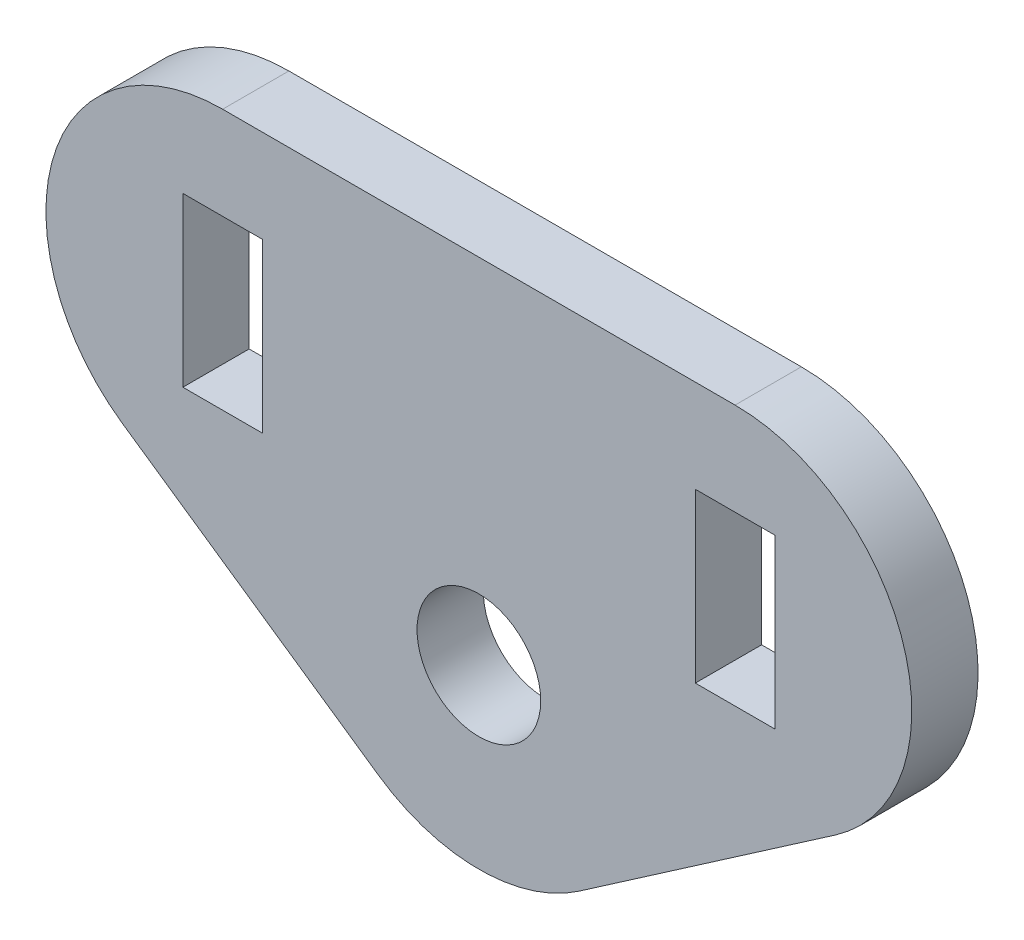
ISO-10303-21;
HEADER;
FILE_DESCRIPTION(('STEP AP214'),'2;1');
FILE_NAME('part.step','',(''),(''),'','','');
FILE_SCHEMA(('AUTOMOTIVE_DESIGN { 1 0 10303 214 1 1 1 1 }'));
ENDSEC;
DATA;
#1=APPLICATION_CONTEXT('core data for automotive mechanical design processes');
#2=APPLICATION_PROTOCOL_DEFINITION('international standard','automotive_design',2000,#1);
#3=PRODUCT_CONTEXT('',#1,'mechanical');
#4=PRODUCT('Part','Part','',(#3));
#5=PRODUCT_RELATED_PRODUCT_CATEGORY('part','',(#4));
#6=PRODUCT_DEFINITION_FORMATION('','',#4);
#7=PRODUCT_DEFINITION_CONTEXT('part definition',#1,'design');
#8=PRODUCT_DEFINITION('design','',#6,#7);
#9=PRODUCT_DEFINITION_SHAPE('','',#8);
#10=(LENGTH_UNIT() NAMED_UNIT(*) SI_UNIT(.MILLI.,.METRE.));
#11=(NAMED_UNIT(*) PLANE_ANGLE_UNIT() SI_UNIT($,.RADIAN.));
#12=(NAMED_UNIT(*) SI_UNIT($,.STERADIAN.) SOLID_ANGLE_UNIT());
#13=UNCERTAINTY_MEASURE_WITH_UNIT(LENGTH_MEASURE(1.E-05),#10,'distance_accuracy_value','');
#14=(GEOMETRIC_REPRESENTATION_CONTEXT(3) GLOBAL_UNCERTAINTY_ASSIGNED_CONTEXT((#13)) GLOBAL_UNIT_ASSIGNED_CONTEXT((#10,
#11,#12)) REPRESENTATION_CONTEXT('',''));
#15=CARTESIAN_POINT('',(0.,0.,0.));
#16=DIRECTION('',(0.,0.,1.));
#17=DIRECTION('',(1.,0.,0.));
#18=AXIS2_PLACEMENT_3D('',#15,#16,#17);
#19=CARTESIAN_POINT('',(0.,0.,15.));
#20=DIRECTION('',(0.,0.,-1.));
#21=DIRECTION('',(-1.,0.,0.));
#22=AXIS2_PLACEMENT_3D('',#19,#20,#21);
#23=PLANE('',#22);
#24=DIRECTION('',(0.,1.,0.));
#25=VECTOR('',#24,1.);
#26=CARTESIAN_POINT('',(-49.,21.,15.));
#27=LINE('',#26,#25);
#28=CARTESIAN_POINT('',(-49.,21.,15.));
#29=VERTEX_POINT('',#28);
#30=CARTESIAN_POINT('',(-49.,59.,15.));
#31=VERTEX_POINT('',#30);
#32=EDGE_CURVE('E334',#29,#31,#27,.T.);
#33=ORIENTED_EDGE('',*,*,#32,.F.);
#34=DIRECTION('',(1.,0.,0.));
#35=VECTOR('',#34,1.);
#36=CARTESIAN_POINT('',(-67.,21.,15.));
#37=LINE('',#36,#35);
#38=CARTESIAN_POINT('',(-67.,21.,15.));
#39=VERTEX_POINT('',#38);
#40=EDGE_CURVE('E328',#39,#29,#37,.T.);
#41=ORIENTED_EDGE('',*,*,#40,.F.);
#42=DIRECTION('',(0.,-1.,0.));
#43=VECTOR('',#42,1.);
#44=CARTESIAN_POINT('',(-67.,21.,15.));
#45=LINE('',#44,#43);
#46=CARTESIAN_POINT('',(-67.,59.,15.));
#47=VERTEX_POINT('',#46);
#48=EDGE_CURVE('E349',#47,#39,#45,.T.);
#49=ORIENTED_EDGE('',*,*,#48,.F.);
#50=DIRECTION('',(-1.,0.,0.));
#51=VECTOR('',#50,1.);
#52=CARTESIAN_POINT('',(-67.,59.,15.));
#53=LINE('',#52,#51);
#54=EDGE_CURVE('E336',#31,#47,#53,.T.);
#55=ORIENTED_EDGE('',*,*,#54,.F.);
#56=EDGE_LOOP('',(#33,#41,#49,#55));
#57=FACE_BOUND('',#56,.T.);
#58=DIRECTION('',(0.823212785915306,-0.567732955803659,0.));
#59=VECTOR('',#58,1.);
#60=CARTESIAN_POINT('',(-186.455659815234,80.,15.));
#61=LINE('',#60,#59);
#62=CARTESIAN_POINT('',(-80.7093182321464,7.07148856338775,15.));
#63=VERTEX_POINT('',#62);
#64=CARTESIAN_POINT('',(-22.7093182321463,-32.9285114366123,15.));
#65=VERTEX_POINT('',#64);
#66=EDGE_CURVE('E197',#63,#65,#61,.T.);
#67=ORIENTED_EDGE('',*,*,#66,.T.);
#68=CARTESIAN_POINT('',(0.,0.,15.));
#69=DIRECTION('',(0.,0.,-1.));
#70=DIRECTION('',(-1.,0.,0.));
#71=AXIS2_PLACEMENT_3D('',#68,#69,#70);
#72=CIRCLE('',#71,40.);
#73=CARTESIAN_POINT('',(22.7093182321464,-32.9285114366123,15.));
#74=VERTEX_POINT('',#73);
#75=EDGE_CURVE('E226',#65,#74,#72,.F.);
#76=ORIENTED_EDGE('',*,*,#75,.T.);
#77=DIRECTION('',(0.823212785915306,0.567732955803659,0.));
#78=VECTOR('',#77,1.);
#79=CARTESIAN_POINT('',(0.,-48.5901102174029,15.));
#80=LINE('',#79,#78);
#81=CARTESIAN_POINT('',(80.7093182321464,7.07148856338775,15.));
#82=VERTEX_POINT('',#81);
#83=EDGE_CURVE('E187',#74,#82,#80,.T.);
#84=ORIENTED_EDGE('',*,*,#83,.T.);
#85=CARTESIAN_POINT('',(58.,40.,15.));
#86=DIRECTION('',(0.,0.,-1.));
#87=DIRECTION('',(-1.,0.,0.));
#88=AXIS2_PLACEMENT_3D('',#85,#86,#87);
#89=CIRCLE('',#88,40.);
#90=CARTESIAN_POINT('',(58.0000000000001,80.,15.));
#91=VERTEX_POINT('',#90);
#92=EDGE_CURVE('E55',#82,#91,#89,.F.);
#93=ORIENTED_EDGE('',*,*,#92,.T.);
#94=DIRECTION('',(-1.,0.,0.));
#95=VECTOR('',#94,1.);
#96=CARTESIAN_POINT('',(186.455659815234,80.,15.));
#97=LINE('',#96,#95);
#98=CARTESIAN_POINT('',(-58.,80.,15.));
#99=VERTEX_POINT('',#98);
#100=EDGE_CURVE('E189',#91,#99,#97,.T.);
#101=ORIENTED_EDGE('',*,*,#100,.T.);
#102=CARTESIAN_POINT('',(-58.,40.,15.));
#103=DIRECTION('',(0.,0.,-1.));
#104=DIRECTION('',(-1.,0.,0.));
#105=AXIS2_PLACEMENT_3D('',#102,#103,#104);
#106=CIRCLE('',#105,40.);
#107=EDGE_CURVE('E224',#99,#63,#106,.F.);
#108=ORIENTED_EDGE('',*,*,#107,.T.);
#109=EDGE_LOOP('',(#67,#76,#84,#93,#101,#108));
#110=FACE_BOUND('',#109,.T.);
#111=CARTESIAN_POINT('',(0.,0.,15.));
#112=DIRECTION('',(0.,0.,1.));
#113=DIRECTION('',(1.,0.,0.));
#114=AXIS2_PLACEMENT_3D('',#111,#112,#113);
#115=CIRCLE('',#114,14.);
#116=CARTESIAN_POINT('',(14.,0.,15.));
#117=VERTEX_POINT('',#116);
#118=EDGE_CURVE('E176',#117,#117,#115,.T.);
#119=ORIENTED_EDGE('',*,*,#118,.F.);
#120=EDGE_LOOP('',(#119));
#121=FACE_BOUND('',#120,.T.);
#122=DIRECTION('',(0.,1.,0.));
#123=VECTOR('',#122,1.);
#124=CARTESIAN_POINT('',(67.,21.,15.));
#125=LINE('',#124,#123);
#126=CARTESIAN_POINT('',(67.,21.,15.));
#127=VERTEX_POINT('',#126);
#128=CARTESIAN_POINT('',(67.,59.,15.));
#129=VERTEX_POINT('',#128);
#130=EDGE_CURVE('E137',#127,#129,#125,.T.);
#131=ORIENTED_EDGE('',*,*,#130,.F.);
#132=DIRECTION('',(1.,0.,0.));
#133=VECTOR('',#132,1.);
#134=CARTESIAN_POINT('',(49.,21.,15.));
#135=LINE('',#134,#133);
#136=CARTESIAN_POINT('',(49.,21.,15.));
#137=VERTEX_POINT('',#136);
#138=EDGE_CURVE('E161',#137,#127,#135,.T.);
#139=ORIENTED_EDGE('',*,*,#138,.F.);
#140=DIRECTION('',(0.,-1.,0.));
#141=VECTOR('',#140,1.);
#142=CARTESIAN_POINT('',(49.,21.,15.));
#143=LINE('',#142,#141);
#144=CARTESIAN_POINT('',(49.,59.,15.));
#145=VERTEX_POINT('',#144);
#146=EDGE_CURVE('E160',#145,#137,#143,.T.);
#147=ORIENTED_EDGE('',*,*,#146,.F.);
#148=DIRECTION('',(-1.,0.,0.));
#149=VECTOR('',#148,1.);
#150=CARTESIAN_POINT('',(49.,59.,15.));
#151=LINE('',#150,#149);
#152=EDGE_CURVE('E147',#129,#145,#151,.T.);
#153=ORIENTED_EDGE('',*,*,#152,.F.);
#154=EDGE_LOOP('',(#131,#139,#147,#153));
#155=FACE_BOUND('',#154,.T.);
#156=ADVANCED_FACE('F35',(#57,#110,#121,#155),#23,.F.);
#157=CARTESIAN_POINT('',(0.,0.,0.));
#158=DIRECTION('',(0.,0.,-1.));
#159=DIRECTION('',(-1.,0.,0.));
#160=AXIS2_PLACEMENT_3D('',#157,#158,#159);
#161=PLANE('',#160);
#162=DIRECTION('',(0.823212785915306,0.567732955803659,0.));
#163=VECTOR('',#162,1.);
#164=CARTESIAN_POINT('',(0.,-48.5901102174029,0.));
#165=LINE('',#164,#163);
#166=CARTESIAN_POINT('',(22.7093182321464,-32.9285114366123,0.));
#167=VERTEX_POINT('',#166);
#168=CARTESIAN_POINT('',(80.7093182321464,7.07148856338775,0.));
#169=VERTEX_POINT('',#168);
#170=EDGE_CURVE('E181',#167,#169,#165,.T.);
#171=ORIENTED_EDGE('',*,*,#170,.F.);
#172=CARTESIAN_POINT('',(0.,0.,0.));
#173=DIRECTION('',(0.,0.,-1.));
#174=DIRECTION('',(-1.,0.,0.));
#175=AXIS2_PLACEMENT_3D('',#172,#173,#174);
#176=CIRCLE('',#175,40.);
#177=CARTESIAN_POINT('',(-22.7093182321463,-32.9285114366123,0.));
#178=VERTEX_POINT('',#177);
#179=EDGE_CURVE('E216',#167,#178,#176,.T.);
#180=ORIENTED_EDGE('',*,*,#179,.T.);
#181=DIRECTION('',(0.823212785915306,-0.567732955803659,0.));
#182=VECTOR('',#181,1.);
#183=CARTESIAN_POINT('',(-186.455659815234,80.,0.));
#184=LINE('',#183,#182);
#185=CARTESIAN_POINT('',(-80.7093182321464,7.07148856338775,0.));
#186=VERTEX_POINT('',#185);
#187=EDGE_CURVE('E190',#186,#178,#184,.T.);
#188=ORIENTED_EDGE('',*,*,#187,.F.);
#189=CARTESIAN_POINT('',(-58.,40.,0.));
#190=DIRECTION('',(0.,0.,-1.));
#191=DIRECTION('',(-1.,0.,0.));
#192=AXIS2_PLACEMENT_3D('',#189,#190,#191);
#193=CIRCLE('',#192,40.);
#194=CARTESIAN_POINT('',(-58.,80.,0.));
#195=VERTEX_POINT('',#194);
#196=EDGE_CURVE('E214',#186,#195,#193,.T.);
#197=ORIENTED_EDGE('',*,*,#196,.T.);
#198=DIRECTION('',(-1.,0.,0.));
#199=VECTOR('',#198,1.);
#200=CARTESIAN_POINT('',(186.455659815234,80.,0.));
#201=LINE('',#200,#199);
#202=CARTESIAN_POINT('',(58.0000000000001,80.,0.));
#203=VERTEX_POINT('',#202);
#204=EDGE_CURVE('E204',#203,#195,#201,.T.);
#205=ORIENTED_EDGE('',*,*,#204,.F.);
#206=CARTESIAN_POINT('',(58.,40.,0.));
#207=DIRECTION('',(0.,0.,-1.));
#208=DIRECTION('',(-1.,0.,0.));
#209=AXIS2_PLACEMENT_3D('',#206,#207,#208);
#210=CIRCLE('',#209,40.);
#211=EDGE_CURVE('E212',#203,#169,#210,.T.);
#212=ORIENTED_EDGE('',*,*,#211,.T.);
#213=EDGE_LOOP('',(#171,#180,#188,#197,#205,#212));
#214=FACE_BOUND('',#213,.T.);
#215=CARTESIAN_POINT('',(0.,0.,0.));
#216=DIRECTION('',(0.,0.,1.));
#217=DIRECTION('',(1.,0.,0.));
#218=AXIS2_PLACEMENT_3D('',#215,#216,#217);
#219=CIRCLE('',#218,14.);
#220=CARTESIAN_POINT('',(14.,0.,0.));
#221=VERTEX_POINT('',#220);
#222=EDGE_CURVE('E182',#221,#221,#219,.T.);
#223=ORIENTED_EDGE('',*,*,#222,.T.);
#224=EDGE_LOOP('',(#223));
#225=FACE_BOUND('',#224,.T.);
#226=DIRECTION('',(1.,0.,0.));
#227=VECTOR('',#226,1.);
#228=CARTESIAN_POINT('',(-67.,21.,0.));
#229=LINE('',#228,#227);
#230=CARTESIAN_POINT('',(-67.,21.,0.));
#231=VERTEX_POINT('',#230);
#232=CARTESIAN_POINT('',(-49.,21.,0.));
#233=VERTEX_POINT('',#232);
#234=EDGE_CURVE('E325',#231,#233,#229,.T.);
#235=ORIENTED_EDGE('',*,*,#234,.T.);
#236=DIRECTION('',(0.,1.,0.));
#237=VECTOR('',#236,1.);
#238=CARTESIAN_POINT('',(-49.,21.,0.));
#239=LINE('',#238,#237);
#240=CARTESIAN_POINT('',(-49.,59.,0.));
#241=VERTEX_POINT('',#240);
#242=EDGE_CURVE('E155',#233,#241,#239,.T.);
#243=ORIENTED_EDGE('',*,*,#242,.T.);
#244=DIRECTION('',(-1.,0.,0.));
#245=VECTOR('',#244,1.);
#246=CARTESIAN_POINT('',(-67.,59.,0.));
#247=LINE('',#246,#245);
#248=CARTESIAN_POINT('',(-67.,59.,0.));
#249=VERTEX_POINT('',#248);
#250=EDGE_CURVE('E322',#241,#249,#247,.T.);
#251=ORIENTED_EDGE('',*,*,#250,.T.);
#252=DIRECTION('',(0.,-1.,0.));
#253=VECTOR('',#252,1.);
#254=CARTESIAN_POINT('',(-67.,21.,0.));
#255=LINE('',#254,#253);
#256=EDGE_CURVE('E333',#249,#231,#255,.T.);
#257=ORIENTED_EDGE('',*,*,#256,.T.);
#258=EDGE_LOOP('',(#235,#243,#251,#257));
#259=FACE_BOUND('',#258,.T.);
#260=DIRECTION('',(1.,0.,0.));
#261=VECTOR('',#260,1.);
#262=CARTESIAN_POINT('',(49.,21.,0.));
#263=LINE('',#262,#261);
#264=CARTESIAN_POINT('',(49.,21.,0.));
#265=VERTEX_POINT('',#264);
#266=CARTESIAN_POINT('',(67.,21.,0.));
#267=VERTEX_POINT('',#266);
#268=EDGE_CURVE('E148',#265,#267,#263,.T.);
#269=ORIENTED_EDGE('',*,*,#268,.T.);
#270=DIRECTION('',(0.,1.,0.));
#271=VECTOR('',#270,1.);
#272=CARTESIAN_POINT('',(67.,21.,0.));
#273=LINE('',#272,#271);
#274=CARTESIAN_POINT('',(67.,59.,0.));
#275=VERTEX_POINT('',#274);
#276=EDGE_CURVE('E365',#267,#275,#273,.T.);
#277=ORIENTED_EDGE('',*,*,#276,.T.);
#278=DIRECTION('',(-1.,0.,0.));
#279=VECTOR('',#278,1.);
#280=CARTESIAN_POINT('',(49.,59.,0.));
#281=LINE('',#280,#279);
#282=CARTESIAN_POINT('',(49.,59.,0.));
#283=VERTEX_POINT('',#282);
#284=EDGE_CURVE('E154',#275,#283,#281,.T.);
#285=ORIENTED_EDGE('',*,*,#284,.T.);
#286=DIRECTION('',(0.,-1.,0.));
#287=VECTOR('',#286,1.);
#288=CARTESIAN_POINT('',(49.,21.,0.));
#289=LINE('',#288,#287);
#290=EDGE_CURVE('E362',#283,#265,#289,.T.);
#291=ORIENTED_EDGE('',*,*,#290,.T.);
#292=EDGE_LOOP('',(#269,#277,#285,#291));
#293=FACE_BOUND('',#292,.T.);
#294=ADVANCED_FACE('F234',(#214,#225,#259,#293),#161,.T.);
#295=CARTESIAN_POINT('',(0.,-48.5901102174029,15.));
#296=DIRECTION('',(-0.567732955803659,0.823212785915306,0.));
#297=DIRECTION('',(-0.823212785915306,-0.567732955803659,0.));
#298=AXIS2_PLACEMENT_3D('',#295,#296,#297);
#299=PLANE('',#298);
#300=ORIENTED_EDGE('',*,*,#83,.F.);
#301=DIRECTION('',(0.,0.,-1.));
#302=VECTOR('',#301,1.);
#303=CARTESIAN_POINT('',(22.7093182321464,-32.9285114366122,15.));
#304=LINE('',#303,#302);
#305=EDGE_CURVE('E209',#74,#167,#304,.T.);
#306=ORIENTED_EDGE('',*,*,#305,.T.);
#307=ORIENTED_EDGE('',*,*,#170,.T.);
#308=DIRECTION('',(0.,0.,-1.));
#309=VECTOR('',#308,1.);
#310=CARTESIAN_POINT('',(80.7093182321464,7.07148856338775,15.));
#311=LINE('',#310,#309);
#312=EDGE_CURVE('E201',#169,#82,#311,.F.);
#313=ORIENTED_EDGE('',*,*,#312,.T.);
#314=EDGE_LOOP('',(#300,#306,#307,#313));
#315=FACE_BOUND('',#314,.T.);
#316=ADVANCED_FACE('F252',(#315),#299,.F.);
#317=CARTESIAN_POINT('',(186.455659815234,80.,15.));
#318=DIRECTION('',(0.,-1.,0.));
#319=DIRECTION('',(1.,0.,0.));
#320=AXIS2_PLACEMENT_3D('',#317,#318,#319);
#321=PLANE('',#320);
#322=ORIENTED_EDGE('',*,*,#204,.T.);
#323=DIRECTION('',(0.,0.,-1.));
#324=VECTOR('',#323,1.);
#325=CARTESIAN_POINT('',(-58.,80.,15.));
#326=LINE('',#325,#324);
#327=EDGE_CURVE('E12',#195,#99,#326,.F.);
#328=ORIENTED_EDGE('',*,*,#327,.T.);
#329=ORIENTED_EDGE('',*,*,#100,.F.);
#330=DIRECTION('',(0.,0.,-1.));
#331=VECTOR('',#330,1.);
#332=CARTESIAN_POINT('',(58.,80.,15.));
#333=LINE('',#332,#331);
#334=EDGE_CURVE('E43',#91,#203,#333,.T.);
#335=ORIENTED_EDGE('',*,*,#334,.T.);
#336=EDGE_LOOP('',(#322,#328,#329,#335));
#337=FACE_BOUND('',#336,.T.);
#338=ADVANCED_FACE('F230',(#337),#321,.F.);
#339=CARTESIAN_POINT('',(-186.455659815234,80.,15.));
#340=DIRECTION('',(0.567732955803659,0.823212785915306,0.));
#341=DIRECTION('',(-0.823212785915307,0.567732955803659,0.));
#342=AXIS2_PLACEMENT_3D('',#339,#340,#341);
#343=PLANE('',#342);
#344=ORIENTED_EDGE('',*,*,#187,.T.);
#345=DIRECTION('',(0.,0.,-1.));
#346=VECTOR('',#345,1.);
#347=CARTESIAN_POINT('',(-22.7093182321463,-32.9285114366123,15.));
#348=LINE('',#347,#346);
#349=EDGE_CURVE('E221',#178,#65,#348,.F.);
#350=ORIENTED_EDGE('',*,*,#349,.T.);
#351=ORIENTED_EDGE('',*,*,#66,.F.);
#352=DIRECTION('',(0.,0.,-1.));
#353=VECTOR('',#352,1.);
#354=CARTESIAN_POINT('',(-80.7093182321464,7.07148856338775,15.));
#355=LINE('',#354,#353);
#356=EDGE_CURVE('E218',#63,#186,#355,.T.);
#357=ORIENTED_EDGE('',*,*,#356,.T.);
#358=EDGE_LOOP('',(#344,#350,#351,#357));
#359=FACE_BOUND('',#358,.T.);
#360=ADVANCED_FACE('F243',(#359),#343,.F.);
#361=CARTESIAN_POINT('',(0.,0.,15.));
#362=DIRECTION('',(0.,0.,-1.));
#363=DIRECTION('',(-1.,0.,0.));
#364=AXIS2_PLACEMENT_3D('',#361,#362,#363);
#365=CYLINDRICAL_SURFACE('',#364,14.);
#366=ORIENTED_EDGE('',*,*,#118,.T.);
#367=EDGE_LOOP('',(#366));
#368=FACE_BOUND('',#367,.T.);
#369=ORIENTED_EDGE('',*,*,#222,.F.);
#370=EDGE_LOOP('',(#369));
#371=FACE_BOUND('',#370,.T.);
#372=ADVANCED_FACE('F267',(#368,#371),#365,.F.);
#373=CARTESIAN_POINT('',(-49.,21.,15.));
#374=DIRECTION('',(-1.,0.,0.));
#375=DIRECTION('',(0.,0.,1.));
#376=AXIS2_PLACEMENT_3D('',#373,#374,#375);
#377=PLANE('',#376);
#378=ORIENTED_EDGE('',*,*,#242,.F.);
#379=DIRECTION('',(0.,0.,-1.));
#380=VECTOR('',#379,1.);
#381=CARTESIAN_POINT('',(-49.,21.,15.));
#382=LINE('',#381,#380);
#383=EDGE_CURVE('E317',#29,#233,#382,.T.);
#384=ORIENTED_EDGE('',*,*,#383,.F.);
#385=ORIENTED_EDGE('',*,*,#32,.T.);
#386=DIRECTION('',(0.,0.,-1.));
#387=VECTOR('',#386,1.);
#388=CARTESIAN_POINT('',(-49.,59.,15.));
#389=LINE('',#388,#387);
#390=EDGE_CURVE('E183',#31,#241,#389,.T.);
#391=ORIENTED_EDGE('',*,*,#390,.T.);
#392=EDGE_LOOP('',(#378,#384,#385,#391));
#393=FACE_BOUND('',#392,.T.);
#394=ADVANCED_FACE('F305',(#393),#377,.T.);
#395=CARTESIAN_POINT('',(-67.,59.,15.));
#396=DIRECTION('',(0.,-1.,0.));
#397=DIRECTION('',(0.,0.,-1.));
#398=AXIS2_PLACEMENT_3D('',#395,#396,#397);
#399=PLANE('',#398);
#400=ORIENTED_EDGE('',*,*,#250,.F.);
#401=ORIENTED_EDGE('',*,*,#390,.F.);
#402=ORIENTED_EDGE('',*,*,#54,.T.);
#403=DIRECTION('',(0.,0.,-1.));
#404=VECTOR('',#403,1.);
#405=CARTESIAN_POINT('',(-67.,59.,15.));
#406=LINE('',#405,#404);
#407=EDGE_CURVE('E341',#47,#249,#406,.T.);
#408=ORIENTED_EDGE('',*,*,#407,.T.);
#409=EDGE_LOOP('',(#400,#401,#402,#408));
#410=FACE_BOUND('',#409,.T.);
#411=ADVANCED_FACE('F302',(#410),#399,.T.);
#412=CARTESIAN_POINT('',(-67.,21.,15.));
#413=DIRECTION('',(1.,0.,0.));
#414=DIRECTION('',(0.,0.,-1.));
#415=AXIS2_PLACEMENT_3D('',#412,#413,#414);
#416=PLANE('',#415);
#417=ORIENTED_EDGE('',*,*,#256,.F.);
#418=ORIENTED_EDGE('',*,*,#407,.F.);
#419=ORIENTED_EDGE('',*,*,#48,.T.);
#420=DIRECTION('',(0.,0.,-1.));
#421=VECTOR('',#420,1.);
#422=CARTESIAN_POINT('',(-67.,21.,15.));
#423=LINE('',#422,#421);
#424=EDGE_CURVE('E329',#39,#231,#423,.T.);
#425=ORIENTED_EDGE('',*,*,#424,.T.);
#426=EDGE_LOOP('',(#417,#418,#419,#425));
#427=FACE_BOUND('',#426,.T.);
#428=ADVANCED_FACE('F298',(#427),#416,.T.);
#429=CARTESIAN_POINT('',(-67.,21.,15.));
#430=DIRECTION('',(0.,1.,0.));
#431=DIRECTION('',(0.,0.,1.));
#432=AXIS2_PLACEMENT_3D('',#429,#430,#431);
#433=PLANE('',#432);
#434=ORIENTED_EDGE('',*,*,#234,.F.);
#435=ORIENTED_EDGE('',*,*,#424,.F.);
#436=ORIENTED_EDGE('',*,*,#40,.T.);
#437=ORIENTED_EDGE('',*,*,#383,.T.);
#438=EDGE_LOOP('',(#434,#435,#436,#437));
#439=FACE_BOUND('',#438,.T.);
#440=ADVANCED_FACE('F295',(#439),#433,.T.);
#441=CARTESIAN_POINT('',(67.,21.,15.));
#442=DIRECTION('',(-1.,0.,0.));
#443=DIRECTION('',(0.,0.,1.));
#444=AXIS2_PLACEMENT_3D('',#441,#442,#443);
#445=PLANE('',#444);
#446=ORIENTED_EDGE('',*,*,#276,.F.);
#447=DIRECTION('',(0.,0.,-1.));
#448=VECTOR('',#447,1.);
#449=CARTESIAN_POINT('',(67.,21.,15.));
#450=LINE('',#449,#448);
#451=EDGE_CURVE('E143',#127,#267,#450,.T.);
#452=ORIENTED_EDGE('',*,*,#451,.F.);
#453=ORIENTED_EDGE('',*,*,#130,.T.);
#454=DIRECTION('',(0.,0.,-1.));
#455=VECTOR('',#454,1.);
#456=CARTESIAN_POINT('',(67.,59.,15.));
#457=LINE('',#456,#455);
#458=EDGE_CURVE('E140',#129,#275,#457,.T.);
#459=ORIENTED_EDGE('',*,*,#458,.T.);
#460=EDGE_LOOP('',(#446,#452,#453,#459));
#461=FACE_BOUND('',#460,.T.);
#462=ADVANCED_FACE('F139',(#461),#445,.T.);
#463=CARTESIAN_POINT('',(49.,59.,15.));
#464=DIRECTION('',(0.,-1.,0.));
#465=DIRECTION('',(0.,0.,-1.));
#466=AXIS2_PLACEMENT_3D('',#463,#464,#465);
#467=PLANE('',#466);
#468=ORIENTED_EDGE('',*,*,#284,.F.);
#469=ORIENTED_EDGE('',*,*,#458,.F.);
#470=ORIENTED_EDGE('',*,*,#152,.T.);
#471=DIRECTION('',(0.,0.,-1.));
#472=VECTOR('',#471,1.);
#473=CARTESIAN_POINT('',(49.,59.,15.));
#474=LINE('',#473,#472);
#475=EDGE_CURVE('E156',#145,#283,#474,.T.);
#476=ORIENTED_EDGE('',*,*,#475,.T.);
#477=EDGE_LOOP('',(#468,#469,#470,#476));
#478=FACE_BOUND('',#477,.T.);
#479=ADVANCED_FACE('F151',(#478),#467,.T.);
#480=CARTESIAN_POINT('',(49.,21.,15.));
#481=DIRECTION('',(1.,0.,0.));
#482=DIRECTION('',(0.,0.,-1.));
#483=AXIS2_PLACEMENT_3D('',#480,#481,#482);
#484=PLANE('',#483);
#485=ORIENTED_EDGE('',*,*,#290,.F.);
#486=ORIENTED_EDGE('',*,*,#475,.F.);
#487=ORIENTED_EDGE('',*,*,#146,.T.);
#488=DIRECTION('',(0.,0.,-1.));
#489=VECTOR('',#488,1.);
#490=CARTESIAN_POINT('',(49.,21.,15.));
#491=LINE('',#490,#489);
#492=EDGE_CURVE('E357',#137,#265,#491,.T.);
#493=ORIENTED_EDGE('',*,*,#492,.T.);
#494=EDGE_LOOP('',(#485,#486,#487,#493));
#495=FACE_BOUND('',#494,.T.);
#496=ADVANCED_FACE('F281',(#495),#484,.T.);
#497=CARTESIAN_POINT('',(49.,21.,15.));
#498=DIRECTION('',(0.,1.,0.));
#499=DIRECTION('',(0.,0.,1.));
#500=AXIS2_PLACEMENT_3D('',#497,#498,#499);
#501=PLANE('',#500);
#502=ORIENTED_EDGE('',*,*,#268,.F.);
#503=ORIENTED_EDGE('',*,*,#492,.F.);
#504=ORIENTED_EDGE('',*,*,#138,.T.);
#505=ORIENTED_EDGE('',*,*,#451,.T.);
#506=EDGE_LOOP('',(#502,#503,#504,#505));
#507=FACE_BOUND('',#506,.T.);
#508=ADVANCED_FACE('F277',(#507),#501,.T.);
#509=CARTESIAN_POINT('',(0.,0.,15.));
#510=DIRECTION('',(0.,0.,-1.));
#511=DIRECTION('',(-1.,0.,0.));
#512=AXIS2_PLACEMENT_3D('',#509,#510,#511);
#513=CYLINDRICAL_SURFACE('',#512,40.);
#514=ORIENTED_EDGE('',*,*,#75,.F.);
#515=ORIENTED_EDGE('',*,*,#349,.F.);
#516=ORIENTED_EDGE('',*,*,#179,.F.);
#517=ORIENTED_EDGE('',*,*,#305,.F.);
#518=EDGE_LOOP('',(#514,#515,#516,#517));
#519=FACE_BOUND('',#518,.T.);
#520=ADVANCED_FACE('F250',(#519),#513,.T.);
#521=CARTESIAN_POINT('',(-58.,40.,15.));
#522=DIRECTION('',(0.,0.,-1.));
#523=DIRECTION('',(-1.,0.,0.));
#524=AXIS2_PLACEMENT_3D('',#521,#522,#523);
#525=CYLINDRICAL_SURFACE('',#524,40.);
#526=ORIENTED_EDGE('',*,*,#107,.F.);
#527=ORIENTED_EDGE('',*,*,#327,.F.);
#528=ORIENTED_EDGE('',*,*,#196,.F.);
#529=ORIENTED_EDGE('',*,*,#356,.F.);
#530=EDGE_LOOP('',(#526,#527,#528,#529));
#531=FACE_BOUND('',#530,.T.);
#532=ADVANCED_FACE('F240',(#531),#525,.T.);
#533=CARTESIAN_POINT('',(58.,40.,15.));
#534=DIRECTION('',(0.,0.,-1.));
#535=DIRECTION('',(-1.,0.,0.));
#536=AXIS2_PLACEMENT_3D('',#533,#534,#535);
#537=CYLINDRICAL_SURFACE('',#536,40.);
#538=ORIENTED_EDGE('',*,*,#92,.F.);
#539=ORIENTED_EDGE('',*,*,#312,.F.);
#540=ORIENTED_EDGE('',*,*,#211,.F.);
#541=ORIENTED_EDGE('',*,*,#334,.F.);
#542=EDGE_LOOP('',(#538,#539,#540,#541));
#543=FACE_BOUND('',#542,.T.);
#544=ADVANCED_FACE('F37',(#543),#537,.T.);
#545=CLOSED_SHELL('',(#156,#294,#316,#338,#360,#372,#394,#411,#428,#440,#462,#479,#496,#508,
#520,#532,#544));
#546=MANIFOLD_SOLID_BREP('B2',#545);
#547=ADVANCED_BREP_SHAPE_REPRESENTATION('',(#18,#546),#14);
#548=SHAPE_DEFINITION_REPRESENTATION(#9,#547);
ENDSEC;
END-ISO-10303-21;
